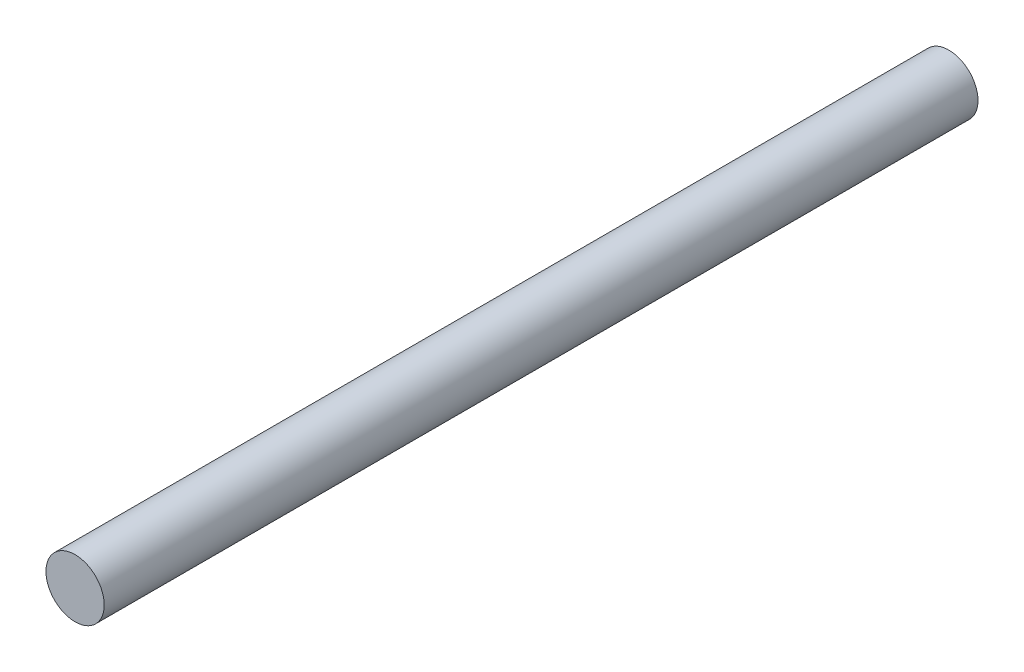
ISO-10303-21;
HEADER;
FILE_DESCRIPTION(('STEP AP214'),'2;1');
FILE_NAME('part.step','',(''),(''),'','','');
FILE_SCHEMA(('AUTOMOTIVE_DESIGN { 1 0 10303 214 1 1 1 1 }'));
ENDSEC;
DATA;
#1=APPLICATION_CONTEXT('core data for automotive mechanical design processes');
#2=APPLICATION_PROTOCOL_DEFINITION('international standard','automotive_design',2000,#1);
#3=PRODUCT_CONTEXT('',#1,'mechanical');
#4=PRODUCT('Part','Part','',(#3));
#5=PRODUCT_RELATED_PRODUCT_CATEGORY('part','',(#4));
#6=PRODUCT_DEFINITION_FORMATION('','',#4);
#7=PRODUCT_DEFINITION_CONTEXT('part definition',#1,'design');
#8=PRODUCT_DEFINITION('design','',#6,#7);
#9=PRODUCT_DEFINITION_SHAPE('','',#8);
#10=(LENGTH_UNIT() NAMED_UNIT(*) SI_UNIT(.MILLI.,.METRE.));
#11=(NAMED_UNIT(*) PLANE_ANGLE_UNIT() SI_UNIT($,.RADIAN.));
#12=(NAMED_UNIT(*) SI_UNIT($,.STERADIAN.) SOLID_ANGLE_UNIT());
#13=UNCERTAINTY_MEASURE_WITH_UNIT(LENGTH_MEASURE(1.E-05),#10,'distance_accuracy_value','');
#14=(GEOMETRIC_REPRESENTATION_CONTEXT(3) GLOBAL_UNCERTAINTY_ASSIGNED_CONTEXT((#13)) GLOBAL_UNIT_ASSIGNED_CONTEXT((#10,
#11,#12)) REPRESENTATION_CONTEXT('',''));
#15=CARTESIAN_POINT('',(0.,0.,0.));
#16=DIRECTION('',(0.,0.,1.));
#17=DIRECTION('',(1.,0.,0.));
#18=AXIS2_PLACEMENT_3D('',#15,#16,#17);
#19=CARTESIAN_POINT('',(0.,0.,190.5));
#20=DIRECTION('',(0.,0.,-1.));
#21=DIRECTION('',(-1.,0.,0.));
#22=AXIS2_PLACEMENT_3D('',#19,#20,#21);
#23=CYLINDRICAL_SURFACE('',#22,6.35);
#24=CARTESIAN_POINT('',(0.,0.,190.5));
#25=DIRECTION('',(0.,0.,1.));
#26=DIRECTION('',(1.,0.,0.));
#27=AXIS2_PLACEMENT_3D('',#24,#25,#26);
#28=CIRCLE('',#27,6.35);
#29=CARTESIAN_POINT('',(6.35,0.,190.5));
#30=VERTEX_POINT('',#29);
#31=EDGE_CURVE('E10',#30,#30,#28,.T.);
#32=ORIENTED_EDGE('',*,*,#31,.F.);
#33=EDGE_LOOP('',(#32));
#34=FACE_BOUND('',#33,.T.);
#35=CARTESIAN_POINT('',(0.,0.,0.));
#36=DIRECTION('',(0.,0.,1.));
#37=DIRECTION('',(1.,0.,0.));
#38=AXIS2_PLACEMENT_3D('',#35,#36,#37);
#39=CIRCLE('',#38,6.35);
#40=CARTESIAN_POINT('',(6.35,0.,0.));
#41=VERTEX_POINT('',#40);
#42=EDGE_CURVE('E40',#41,#41,#39,.T.);
#43=ORIENTED_EDGE('',*,*,#42,.T.);
#44=EDGE_LOOP('',(#43));
#45=FACE_BOUND('',#44,.T.);
#46=ADVANCED_FACE('F37',(#34,#45),#23,.T.);
#47=CARTESIAN_POINT('',(0.,0.,190.5));
#48=DIRECTION('',(0.,0.,1.));
#49=DIRECTION('',(1.,0.,0.));
#50=AXIS2_PLACEMENT_3D('',#47,#48,#49);
#51=PLANE('',#50);
#52=ORIENTED_EDGE('',*,*,#31,.T.);
#53=EDGE_LOOP('',(#52));
#54=FACE_BOUND('',#53,.T.);
#55=ADVANCED_FACE('F54',(#54),#51,.T.);
#56=CARTESIAN_POINT('',(0.,0.,0.));
#57=DIRECTION('',(0.,0.,1.));
#58=DIRECTION('',(1.,0.,0.));
#59=AXIS2_PLACEMENT_3D('',#56,#57,#58);
#60=PLANE('',#59);
#61=ORIENTED_EDGE('',*,*,#42,.F.);
#62=EDGE_LOOP('',(#61));
#63=FACE_BOUND('',#62,.T.);
#64=ADVANCED_FACE('F52',(#63),#60,.F.);
#65=CLOSED_SHELL('',(#46,#55,#64));
#66=MANIFOLD_SOLID_BREP('B2',#65);
#67=ADVANCED_BREP_SHAPE_REPRESENTATION('',(#18,#66),#14);
#68=SHAPE_DEFINITION_REPRESENTATION(#9,#67);
ENDSEC;
END-ISO-10303-21;
